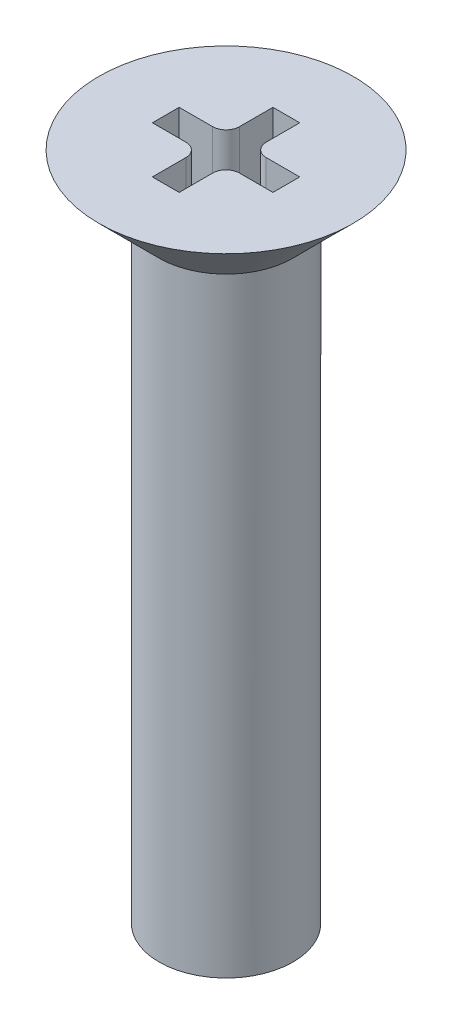
ISO-10303-21;
HEADER;
FILE_DESCRIPTION(('STEP AP214'),'2;1');
FILE_NAME('part.step','',(''),(''),'','','');
FILE_SCHEMA(('AUTOMOTIVE_DESIGN { 1 0 10303 214 1 1 1 1 }'));
ENDSEC;
DATA;
#1=APPLICATION_CONTEXT('core data for automotive mechanical design processes');
#2=APPLICATION_PROTOCOL_DEFINITION('international standard','automotive_design',2000,#1);
#3=PRODUCT_CONTEXT('',#1,'mechanical');
#4=PRODUCT('Part','Part','',(#3));
#5=PRODUCT_RELATED_PRODUCT_CATEGORY('part','',(#4));
#6=PRODUCT_DEFINITION_FORMATION('','',#4);
#7=PRODUCT_DEFINITION_CONTEXT('part definition',#1,'design');
#8=PRODUCT_DEFINITION('design','',#6,#7);
#9=PRODUCT_DEFINITION_SHAPE('','',#8);
#10=(LENGTH_UNIT() NAMED_UNIT(*) SI_UNIT(.MILLI.,.METRE.));
#11=(NAMED_UNIT(*) PLANE_ANGLE_UNIT() SI_UNIT($,.RADIAN.));
#12=(NAMED_UNIT(*) SI_UNIT($,.STERADIAN.) SOLID_ANGLE_UNIT());
#13=UNCERTAINTY_MEASURE_WITH_UNIT(LENGTH_MEASURE(1.E-05),#10,'distance_accuracy_value','');
#14=(GEOMETRIC_REPRESENTATION_CONTEXT(3) GLOBAL_UNCERTAINTY_ASSIGNED_CONTEXT((#13)) GLOBAL_UNIT_ASSIGNED_CONTEXT((#10,
#11,#12)) REPRESENTATION_CONTEXT('',''));
#15=CARTESIAN_POINT('',(0.,0.,0.));
#16=DIRECTION('',(0.,0.,1.));
#17=DIRECTION('',(1.,0.,0.));
#18=AXIS2_PLACEMENT_3D('',#15,#16,#17);
#19=CARTESIAN_POINT('',(0.,0.,0.));
#20=DIRECTION('',(0.,1.,0.));
#21=DIRECTION('',(0.,0.,1.));
#22=AXIS2_PLACEMENT_3D('',#19,#20,#21);
#23=PLANE('',#22);
#24=CARTESIAN_POINT('',(0.,0.,0.));
#25=DIRECTION('',(0.,1.,0.));
#26=DIRECTION('',(0.,0.,1.));
#27=AXIS2_PLACEMENT_3D('',#24,#25,#26);
#28=CIRCLE('',#27,1.9);
#29=CARTESIAN_POINT('',(0.,0.,1.9));
#30=VERTEX_POINT('',#29);
#31=EDGE_CURVE('E11',#30,#30,#28,.T.);
#32=ORIENTED_EDGE('',*,*,#31,.T.);
#33=EDGE_LOOP('',(#32));
#34=FACE_BOUND('',#33,.T.);
#35=DIRECTION('',(-1.,0.,0.));
#36=VECTOR('',#35,1.);
#37=CARTESIAN_POINT('',(0.4,0.,-0.2));
#38=LINE('',#37,#36);
#39=CARTESIAN_POINT('',(0.9,0.,-0.2));
#40=VERTEX_POINT('',#39);
#41=CARTESIAN_POINT('',(0.4,0.,-0.2));
#42=VERTEX_POINT('',#41);
#43=EDGE_CURVE('E48',#40,#42,#38,.T.);
#44=ORIENTED_EDGE('',*,*,#43,.F.);
#45=DIRECTION('',(0.,0.,-1.));
#46=VECTOR('',#45,1.);
#47=CARTESIAN_POINT('',(0.9,0.,0.2));
#48=LINE('',#47,#46);
#49=CARTESIAN_POINT('',(0.9,0.,0.2));
#50=VERTEX_POINT('',#49);
#51=EDGE_CURVE('E221',#50,#40,#48,.T.);
#52=ORIENTED_EDGE('',*,*,#51,.F.);
#53=DIRECTION('',(1.,0.,0.));
#54=VECTOR('',#53,1.);
#55=CARTESIAN_POINT('',(0.4,0.,0.2));
#56=LINE('',#55,#54);
#57=CARTESIAN_POINT('',(0.4,0.,0.2));
#58=VERTEX_POINT('',#57);
#59=EDGE_CURVE('E219',#58,#50,#56,.T.);
#60=ORIENTED_EDGE('',*,*,#59,.F.);
#61=CARTESIAN_POINT('',(0.4,0.,0.4));
#62=DIRECTION('',(0.,-1.,0.));
#63=DIRECTION('',(0.,0.,1.));
#64=AXIS2_PLACEMENT_3D('',#61,#62,#63);
#65=CIRCLE('',#64,0.2);
#66=CARTESIAN_POINT('',(0.2,0.,0.4));
#67=VERTEX_POINT('',#66);
#68=EDGE_CURVE('E156',#67,#58,#65,.T.);
#69=ORIENTED_EDGE('',*,*,#68,.F.);
#70=DIRECTION('',(0.,0.,-1.));
#71=VECTOR('',#70,1.);
#72=CARTESIAN_POINT('',(0.2,0.,0.9));
#73=LINE('',#72,#71);
#74=CARTESIAN_POINT('',(0.2,0.,0.9));
#75=VERTEX_POINT('',#74);
#76=EDGE_CURVE('E215',#75,#67,#73,.T.);
#77=ORIENTED_EDGE('',*,*,#76,.F.);
#78=DIRECTION('',(1.,0.,0.));
#79=VECTOR('',#78,1.);
#80=CARTESIAN_POINT('',(-0.2,0.,0.9));
#81=LINE('',#80,#79);
#82=CARTESIAN_POINT('',(-0.2,0.,0.9));
#83=VERTEX_POINT('',#82);
#84=EDGE_CURVE('E212',#83,#75,#81,.T.);
#85=ORIENTED_EDGE('',*,*,#84,.F.);
#86=DIRECTION('',(0.,0.,1.));
#87=VECTOR('',#86,1.);
#88=CARTESIAN_POINT('',(-0.2,0.,0.9));
#89=LINE('',#88,#87);
#90=CARTESIAN_POINT('',(-0.2,0.,0.4));
#91=VERTEX_POINT('',#90);
#92=EDGE_CURVE('E209',#91,#83,#89,.T.);
#93=ORIENTED_EDGE('',*,*,#92,.F.);
#94=CARTESIAN_POINT('',(-0.4,0.,0.4));
#95=DIRECTION('',(0.,-1.,0.));
#96=DIRECTION('',(0.,0.,1.));
#97=AXIS2_PLACEMENT_3D('',#94,#95,#96);
#98=CIRCLE('',#97,0.2);
#99=CARTESIAN_POINT('',(-0.4,0.,0.2));
#100=VERTEX_POINT('',#99);
#101=EDGE_CURVE('E206',#100,#91,#98,.T.);
#102=ORIENTED_EDGE('',*,*,#101,.F.);
#103=DIRECTION('',(1.,0.,0.));
#104=VECTOR('',#103,1.);
#105=CARTESIAN_POINT('',(-0.9,0.,0.2));
#106=LINE('',#105,#104);
#107=CARTESIAN_POINT('',(-0.9,0.,0.2));
#108=VERTEX_POINT('',#107);
#109=EDGE_CURVE('E203',#108,#100,#106,.T.);
#110=ORIENTED_EDGE('',*,*,#109,.F.);
#111=DIRECTION('',(0.,0.,1.));
#112=VECTOR('',#111,1.);
#113=CARTESIAN_POINT('',(-0.9,0.,0.2));
#114=LINE('',#113,#112);
#115=CARTESIAN_POINT('',(-0.9,0.,-0.2));
#116=VERTEX_POINT('',#115);
#117=EDGE_CURVE('E200',#116,#108,#114,.T.);
#118=ORIENTED_EDGE('',*,*,#117,.F.);
#119=DIRECTION('',(-1.,0.,0.));
#120=VECTOR('',#119,1.);
#121=CARTESIAN_POINT('',(-0.9,0.,-0.2));
#122=LINE('',#121,#120);
#123=CARTESIAN_POINT('',(-0.4,0.,-0.2));
#124=VERTEX_POINT('',#123);
#125=EDGE_CURVE('E197',#124,#116,#122,.T.);
#126=ORIENTED_EDGE('',*,*,#125,.F.);
#127=CARTESIAN_POINT('',(-0.4,0.,-0.4));
#128=DIRECTION('',(0.,-1.,0.));
#129=DIRECTION('',(0.,0.,1.));
#130=AXIS2_PLACEMENT_3D('',#127,#128,#129);
#131=CIRCLE('',#130,0.2);
#132=CARTESIAN_POINT('',(-0.2,0.,-0.4));
#133=VERTEX_POINT('',#132);
#134=EDGE_CURVE('E194',#133,#124,#131,.T.);
#135=ORIENTED_EDGE('',*,*,#134,.F.);
#136=DIRECTION('',(0.,0.,1.));
#137=VECTOR('',#136,1.);
#138=CARTESIAN_POINT('',(-0.2,0.,-0.4));
#139=LINE('',#138,#137);
#140=CARTESIAN_POINT('',(-0.2,0.,-0.9));
#141=VERTEX_POINT('',#140);
#142=EDGE_CURVE('E191',#141,#133,#139,.T.);
#143=ORIENTED_EDGE('',*,*,#142,.F.);
#144=DIRECTION('',(-1.,0.,0.));
#145=VECTOR('',#144,1.);
#146=CARTESIAN_POINT('',(-0.2,0.,-0.9));
#147=LINE('',#146,#145);
#148=CARTESIAN_POINT('',(0.2,0.,-0.9));
#149=VERTEX_POINT('',#148);
#150=EDGE_CURVE('E188',#149,#141,#147,.T.);
#151=ORIENTED_EDGE('',*,*,#150,.F.);
#152=DIRECTION('',(0.,0.,-1.));
#153=VECTOR('',#152,1.);
#154=CARTESIAN_POINT('',(0.2,0.,-0.4));
#155=LINE('',#154,#153);
#156=CARTESIAN_POINT('',(0.2,0.,-0.4));
#157=VERTEX_POINT('',#156);
#158=EDGE_CURVE('E185',#157,#149,#155,.T.);
#159=ORIENTED_EDGE('',*,*,#158,.F.);
#160=CARTESIAN_POINT('',(0.4,0.,-0.4));
#161=DIRECTION('',(0.,-1.,0.));
#162=DIRECTION('',(0.,0.,1.));
#163=AXIS2_PLACEMENT_3D('',#160,#161,#162);
#164=CIRCLE('',#163,0.2);
#165=EDGE_CURVE('E182',#42,#157,#164,.T.);
#166=ORIENTED_EDGE('',*,*,#165,.F.);
#167=EDGE_LOOP('',(#44,#52,#60,#69,#77,#85,#93,#102,#110,#118,#126,#135,#143,#151,#159,#166));
#168=FACE_BOUND('',#167,.T.);
#169=ADVANCED_FACE('F34',(#34,#168),#23,.T.);
#170=CARTESIAN_POINT('',(0.,0.,0.));
#171=DIRECTION('',(0.,1.,0.));
#172=DIRECTION('',(0.,0.,1.));
#173=AXIS2_PLACEMENT_3D('',#170,#171,#172);
#174=CONICAL_SURFACE('',#173,1.9,0.785398163397447);
#175=CARTESIAN_POINT('',(0.,-0.900000000000003,0.));
#176=DIRECTION('',(0.,1.,0.));
#177=DIRECTION('',(0.,0.,1.));
#178=AXIS2_PLACEMENT_3D('',#175,#176,#177);
#179=CIRCLE('',#178,1.);
#180=CARTESIAN_POINT('',(0.,-0.900000000000003,1.));
#181=VERTEX_POINT('',#180);
#182=EDGE_CURVE('E41',#181,#181,#179,.T.);
#183=ORIENTED_EDGE('',*,*,#182,.T.);
#184=EDGE_LOOP('',(#183));
#185=FACE_BOUND('',#184,.T.);
#186=ORIENTED_EDGE('',*,*,#31,.F.);
#187=EDGE_LOOP('',(#186));
#188=FACE_BOUND('',#187,.T.);
#189=ADVANCED_FACE('F255',(#185,#188),#174,.T.);
#190=CARTESIAN_POINT('',(0.,0.872326938896606,0.));
#191=DIRECTION('',(0.,1.,0.));
#192=DIRECTION('',(0.,0.,1.));
#193=AXIS2_PLACEMENT_3D('',#190,#191,#192);
#194=CYLINDRICAL_SURFACE('',#193,1.);
#195=ORIENTED_EDGE('',*,*,#182,.F.);
#196=EDGE_LOOP('',(#195));
#197=FACE_BOUND('',#196,.T.);
#198=CARTESIAN_POINT('',(0.,-10.,0.));
#199=DIRECTION('',(0.,-1.,0.));
#200=DIRECTION('',(0.,0.,-1.));
#201=AXIS2_PLACEMENT_3D('',#198,#199,#200);
#202=CIRCLE('',#201,1.);
#203=CARTESIAN_POINT('',(0.,-10.,-1.));
#204=VERTEX_POINT('',#203);
#205=EDGE_CURVE('E225',#204,#204,#202,.T.);
#206=ORIENTED_EDGE('',*,*,#205,.F.);
#207=EDGE_LOOP('',(#206));
#208=FACE_BOUND('',#207,.T.);
#209=ADVANCED_FACE('F258',(#197,#208),#194,.T.);
#210=CARTESIAN_POINT('',(0.,-10.,0.));
#211=DIRECTION('',(0.,-1.,0.));
#212=DIRECTION('',(0.,0.,-1.));
#213=AXIS2_PLACEMENT_3D('',#210,#211,#212);
#214=PLANE('',#213);
#215=ORIENTED_EDGE('',*,*,#205,.T.);
#216=EDGE_LOOP('',(#215));
#217=FACE_BOUND('',#216,.T.);
#218=ADVANCED_FACE('F261',(#217),#214,.T.);
#219=CARTESIAN_POINT('',(0.4,-1.,-0.2));
#220=DIRECTION('',(0.,0.,-1.));
#221=DIRECTION('',(-1.,0.,0.));
#222=AXIS2_PLACEMENT_3D('',#219,#220,#221);
#223=PLANE('',#222);
#224=ORIENTED_EDGE('',*,*,#43,.T.);
#225=DIRECTION('',(0.,1.,0.));
#226=VECTOR('',#225,1.);
#227=CARTESIAN_POINT('',(0.4,-1.,-0.2));
#228=LINE('',#227,#226);
#229=CARTESIAN_POINT('',(0.4,-1.,-0.2));
#230=VERTEX_POINT('',#229);
#231=EDGE_CURVE('E108',#230,#42,#228,.T.);
#232=ORIENTED_EDGE('',*,*,#231,.F.);
#233=DIRECTION('',(-1.,0.,0.));
#234=VECTOR('',#233,1.);
#235=CARTESIAN_POINT('',(0.4,-1.,-0.2));
#236=LINE('',#235,#234);
#237=CARTESIAN_POINT('',(0.9,-1.,-0.2));
#238=VERTEX_POINT('',#237);
#239=EDGE_CURVE('E223',#238,#230,#236,.T.);
#240=ORIENTED_EDGE('',*,*,#239,.F.);
#241=DIRECTION('',(0.,1.,0.));
#242=VECTOR('',#241,1.);
#243=CARTESIAN_POINT('',(0.9,-1.,-0.2));
#244=LINE('',#243,#242);
#245=EDGE_CURVE('E56',#238,#40,#244,.T.);
#246=ORIENTED_EDGE('',*,*,#245,.T.);
#247=EDGE_LOOP('',(#224,#232,#240,#246));
#248=FACE_BOUND('',#247,.T.);
#249=ADVANCED_FACE('F266',(#248),#223,.F.);
#250=CARTESIAN_POINT('',(0.9,-1.,0.2));
#251=DIRECTION('',(1.,0.,0.));
#252=DIRECTION('',(0.,0.,-1.));
#253=AXIS2_PLACEMENT_3D('',#250,#251,#252);
#254=PLANE('',#253);
#255=ORIENTED_EDGE('',*,*,#51,.T.);
#256=ORIENTED_EDGE('',*,*,#245,.F.);
#257=DIRECTION('',(0.,0.,-1.));
#258=VECTOR('',#257,1.);
#259=CARTESIAN_POINT('',(0.9,-1.,0.2));
#260=LINE('',#259,#258);
#261=CARTESIAN_POINT('',(0.9,-1.,0.2));
#262=VERTEX_POINT('',#261);
#263=EDGE_CURVE('E168',#262,#238,#260,.T.);
#264=ORIENTED_EDGE('',*,*,#263,.F.);
#265=DIRECTION('',(0.,1.,0.));
#266=VECTOR('',#265,1.);
#267=CARTESIAN_POINT('',(0.9,-1.,0.2));
#268=LINE('',#267,#266);
#269=EDGE_CURVE('E160',#262,#50,#268,.T.);
#270=ORIENTED_EDGE('',*,*,#269,.T.);
#271=EDGE_LOOP('',(#255,#256,#264,#270));
#272=FACE_BOUND('',#271,.T.);
#273=ADVANCED_FACE('F271',(#272),#254,.F.);
#274=CARTESIAN_POINT('',(0.4,-1.,0.2));
#275=DIRECTION('',(0.,0.,1.));
#276=DIRECTION('',(1.,0.,0.));
#277=AXIS2_PLACEMENT_3D('',#274,#275,#276);
#278=PLANE('',#277);
#279=ORIENTED_EDGE('',*,*,#59,.T.);
#280=ORIENTED_EDGE('',*,*,#269,.F.);
#281=DIRECTION('',(1.,0.,0.));
#282=VECTOR('',#281,1.);
#283=CARTESIAN_POINT('',(0.4,-1.,0.2));
#284=LINE('',#283,#282);
#285=CARTESIAN_POINT('',(0.4,-1.,0.2));
#286=VERTEX_POINT('',#285);
#287=EDGE_CURVE('E164',#286,#262,#284,.T.);
#288=ORIENTED_EDGE('',*,*,#287,.F.);
#289=DIRECTION('',(0.,1.,0.));
#290=VECTOR('',#289,1.);
#291=CARTESIAN_POINT('',(0.4,-1.,0.2));
#292=LINE('',#291,#290);
#293=EDGE_CURVE('E149',#286,#58,#292,.T.);
#294=ORIENTED_EDGE('',*,*,#293,.T.);
#295=EDGE_LOOP('',(#279,#280,#288,#294));
#296=FACE_BOUND('',#295,.T.);
#297=ADVANCED_FACE('F165',(#296),#278,.F.);
#298=CARTESIAN_POINT('',(0.4,-1.,0.4));
#299=DIRECTION('',(0.,1.,0.));
#300=DIRECTION('',(0.,0.,1.));
#301=AXIS2_PLACEMENT_3D('',#298,#299,#300);
#302=CYLINDRICAL_SURFACE('',#301,0.2);
#303=ORIENTED_EDGE('',*,*,#68,.T.);
#304=ORIENTED_EDGE('',*,*,#293,.F.);
#305=CARTESIAN_POINT('',(0.4,-1.,0.4));
#306=DIRECTION('',(0.,-1.,0.));
#307=DIRECTION('',(0.,0.,1.));
#308=AXIS2_PLACEMENT_3D('',#305,#306,#307);
#309=CIRCLE('',#308,0.2);
#310=CARTESIAN_POINT('',(0.2,-1.,0.4));
#311=VERTEX_POINT('',#310);
#312=EDGE_CURVE('E153',#311,#286,#309,.T.);
#313=ORIENTED_EDGE('',*,*,#312,.F.);
#314=DIRECTION('',(0.,1.,0.));
#315=VECTOR('',#314,1.);
#316=CARTESIAN_POINT('',(0.2,-1.,0.4));
#317=LINE('',#316,#315);
#318=EDGE_CURVE('E161',#311,#67,#317,.T.);
#319=ORIENTED_EDGE('',*,*,#318,.T.);
#320=EDGE_LOOP('',(#303,#304,#313,#319));
#321=FACE_BOUND('',#320,.T.);
#322=ADVANCED_FACE('F151',(#321),#302,.T.);
#323=CARTESIAN_POINT('',(0.2,-1.,0.9));
#324=DIRECTION('',(1.,0.,0.));
#325=DIRECTION('',(0.,0.,-1.));
#326=AXIS2_PLACEMENT_3D('',#323,#324,#325);
#327=PLANE('',#326);
#328=ORIENTED_EDGE('',*,*,#76,.T.);
#329=ORIENTED_EDGE('',*,*,#318,.F.);
#330=DIRECTION('',(0.,0.,-1.));
#331=VECTOR('',#330,1.);
#332=CARTESIAN_POINT('',(0.2,-1.,0.9));
#333=LINE('',#332,#331);
#334=CARTESIAN_POINT('',(0.2,-1.,0.9));
#335=VERTEX_POINT('',#334);
#336=EDGE_CURVE('E174',#335,#311,#333,.T.);
#337=ORIENTED_EDGE('',*,*,#336,.F.);
#338=DIRECTION('',(0.,1.,0.));
#339=VECTOR('',#338,1.);
#340=CARTESIAN_POINT('',(0.2,-1.,0.9));
#341=LINE('',#340,#339);
#342=EDGE_CURVE('E228',#335,#75,#341,.T.);
#343=ORIENTED_EDGE('',*,*,#342,.T.);
#344=EDGE_LOOP('',(#328,#329,#337,#343));
#345=FACE_BOUND('',#344,.T.);
#346=ADVANCED_FACE('F325',(#345),#327,.F.);
#347=CARTESIAN_POINT('',(-0.2,-1.,0.9));
#348=DIRECTION('',(0.,0.,1.));
#349=DIRECTION('',(1.,0.,0.));
#350=AXIS2_PLACEMENT_3D('',#347,#348,#349);
#351=PLANE('',#350);
#352=ORIENTED_EDGE('',*,*,#84,.T.);
#353=ORIENTED_EDGE('',*,*,#342,.F.);
#354=DIRECTION('',(1.,0.,0.));
#355=VECTOR('',#354,1.);
#356=CARTESIAN_POINT('',(-0.2,-1.,0.9));
#357=LINE('',#356,#355);
#358=CARTESIAN_POINT('',(-0.2,-1.,0.9));
#359=VERTEX_POINT('',#358);
#360=EDGE_CURVE('E176',#359,#335,#357,.T.);
#361=ORIENTED_EDGE('',*,*,#360,.F.);
#362=DIRECTION('',(0.,1.,0.));
#363=VECTOR('',#362,1.);
#364=CARTESIAN_POINT('',(-0.2,-1.,0.9));
#365=LINE('',#364,#363);
#366=EDGE_CURVE('E230',#359,#83,#365,.T.);
#367=ORIENTED_EDGE('',*,*,#366,.T.);
#368=EDGE_LOOP('',(#352,#353,#361,#367));
#369=FACE_BOUND('',#368,.T.);
#370=ADVANCED_FACE('F321',(#369),#351,.F.);
#371=CARTESIAN_POINT('',(-0.2,-1.,0.9));
#372=DIRECTION('',(-1.,0.,0.));
#373=DIRECTION('',(0.,0.,1.));
#374=AXIS2_PLACEMENT_3D('',#371,#372,#373);
#375=PLANE('',#374);
#376=ORIENTED_EDGE('',*,*,#92,.T.);
#377=ORIENTED_EDGE('',*,*,#366,.F.);
#378=DIRECTION('',(0.,0.,1.));
#379=VECTOR('',#378,1.);
#380=CARTESIAN_POINT('',(-0.2,-1.,0.9));
#381=LINE('',#380,#379);
#382=CARTESIAN_POINT('',(-0.2,-1.,0.4));
#383=VERTEX_POINT('',#382);
#384=EDGE_CURVE('E316',#383,#359,#381,.T.);
#385=ORIENTED_EDGE('',*,*,#384,.F.);
#386=DIRECTION('',(0.,1.,0.));
#387=VECTOR('',#386,1.);
#388=CARTESIAN_POINT('',(-0.2,-1.,0.4));
#389=LINE('',#388,#387);
#390=EDGE_CURVE('E232',#383,#91,#389,.T.);
#391=ORIENTED_EDGE('',*,*,#390,.T.);
#392=EDGE_LOOP('',(#376,#377,#385,#391));
#393=FACE_BOUND('',#392,.T.);
#394=ADVANCED_FACE('F330',(#393),#375,.F.);
#395=CARTESIAN_POINT('',(-0.4,-1.,0.4));
#396=DIRECTION('',(0.,1.,0.));
#397=DIRECTION('',(0.,0.,1.));
#398=AXIS2_PLACEMENT_3D('',#395,#396,#397);
#399=CYLINDRICAL_SURFACE('',#398,0.2);
#400=ORIENTED_EDGE('',*,*,#101,.T.);
#401=ORIENTED_EDGE('',*,*,#390,.F.);
#402=CARTESIAN_POINT('',(-0.4,-1.,0.4));
#403=DIRECTION('',(0.,-1.,0.));
#404=DIRECTION('',(0.,0.,1.));
#405=AXIS2_PLACEMENT_3D('',#402,#403,#404);
#406=CIRCLE('',#405,0.2);
#407=CARTESIAN_POINT('',(-0.4,-1.,0.2));
#408=VERTEX_POINT('',#407);
#409=EDGE_CURVE('E313',#408,#383,#406,.T.);
#410=ORIENTED_EDGE('',*,*,#409,.F.);
#411=DIRECTION('',(0.,1.,0.));
#412=VECTOR('',#411,1.);
#413=CARTESIAN_POINT('',(-0.4,-1.,0.2));
#414=LINE('',#413,#412);
#415=EDGE_CURVE('E234',#408,#100,#414,.T.);
#416=ORIENTED_EDGE('',*,*,#415,.T.);
#417=EDGE_LOOP('',(#400,#401,#410,#416));
#418=FACE_BOUND('',#417,.T.);
#419=ADVANCED_FACE('F333',(#418),#399,.T.);
#420=CARTESIAN_POINT('',(-0.9,-1.,0.2));
#421=DIRECTION('',(0.,0.,1.));
#422=DIRECTION('',(1.,0.,0.));
#423=AXIS2_PLACEMENT_3D('',#420,#421,#422);
#424=PLANE('',#423);
#425=ORIENTED_EDGE('',*,*,#109,.T.);
#426=ORIENTED_EDGE('',*,*,#415,.F.);
#427=DIRECTION('',(1.,0.,0.));
#428=VECTOR('',#427,1.);
#429=CARTESIAN_POINT('',(-0.9,-1.,0.2));
#430=LINE('',#429,#428);
#431=CARTESIAN_POINT('',(-0.9,-1.,0.2));
#432=VERTEX_POINT('',#431);
#433=EDGE_CURVE('E310',#432,#408,#430,.T.);
#434=ORIENTED_EDGE('',*,*,#433,.F.);
#435=DIRECTION('',(0.,1.,0.));
#436=VECTOR('',#435,1.);
#437=CARTESIAN_POINT('',(-0.9,-1.,0.2));
#438=LINE('',#437,#436);
#439=EDGE_CURVE('E236',#432,#108,#438,.T.);
#440=ORIENTED_EDGE('',*,*,#439,.T.);
#441=EDGE_LOOP('',(#425,#426,#434,#440));
#442=FACE_BOUND('',#441,.T.);
#443=ADVANCED_FACE('F336',(#442),#424,.F.);
#444=CARTESIAN_POINT('',(-0.9,-1.,0.2));
#445=DIRECTION('',(-1.,0.,0.));
#446=DIRECTION('',(0.,0.,1.));
#447=AXIS2_PLACEMENT_3D('',#444,#445,#446);
#448=PLANE('',#447);
#449=ORIENTED_EDGE('',*,*,#117,.T.);
#450=ORIENTED_EDGE('',*,*,#439,.F.);
#451=DIRECTION('',(0.,0.,1.));
#452=VECTOR('',#451,1.);
#453=CARTESIAN_POINT('',(-0.9,-1.,0.2));
#454=LINE('',#453,#452);
#455=CARTESIAN_POINT('',(-0.9,-1.,-0.2));
#456=VERTEX_POINT('',#455);
#457=EDGE_CURVE('E307',#456,#432,#454,.T.);
#458=ORIENTED_EDGE('',*,*,#457,.F.);
#459=DIRECTION('',(0.,1.,0.));
#460=VECTOR('',#459,1.);
#461=CARTESIAN_POINT('',(-0.9,-1.,-0.2));
#462=LINE('',#461,#460);
#463=EDGE_CURVE('E238',#456,#116,#462,.T.);
#464=ORIENTED_EDGE('',*,*,#463,.T.);
#465=EDGE_LOOP('',(#449,#450,#458,#464));
#466=FACE_BOUND('',#465,.T.);
#467=ADVANCED_FACE('F341',(#466),#448,.F.);
#468=CARTESIAN_POINT('',(-0.9,-1.,-0.2));
#469=DIRECTION('',(0.,0.,-1.));
#470=DIRECTION('',(-1.,0.,0.));
#471=AXIS2_PLACEMENT_3D('',#468,#469,#470);
#472=PLANE('',#471);
#473=ORIENTED_EDGE('',*,*,#125,.T.);
#474=ORIENTED_EDGE('',*,*,#463,.F.);
#475=DIRECTION('',(-1.,0.,0.));
#476=VECTOR('',#475,1.);
#477=CARTESIAN_POINT('',(-0.9,-1.,-0.2));
#478=LINE('',#477,#476);
#479=CARTESIAN_POINT('',(-0.4,-1.,-0.2));
#480=VERTEX_POINT('',#479);
#481=EDGE_CURVE('E304',#480,#456,#478,.T.);
#482=ORIENTED_EDGE('',*,*,#481,.F.);
#483=DIRECTION('',(0.,1.,0.));
#484=VECTOR('',#483,1.);
#485=CARTESIAN_POINT('',(-0.4,-1.,-0.2));
#486=LINE('',#485,#484);
#487=EDGE_CURVE('E240',#480,#124,#486,.T.);
#488=ORIENTED_EDGE('',*,*,#487,.T.);
#489=EDGE_LOOP('',(#473,#474,#482,#488));
#490=FACE_BOUND('',#489,.T.);
#491=ADVANCED_FACE('F345',(#490),#472,.F.);
#492=CARTESIAN_POINT('',(-0.4,-1.,-0.4));
#493=DIRECTION('',(0.,1.,0.));
#494=DIRECTION('',(0.,0.,1.));
#495=AXIS2_PLACEMENT_3D('',#492,#493,#494);
#496=CYLINDRICAL_SURFACE('',#495,0.2);
#497=ORIENTED_EDGE('',*,*,#134,.T.);
#498=ORIENTED_EDGE('',*,*,#487,.F.);
#499=CARTESIAN_POINT('',(-0.4,-1.,-0.4));
#500=DIRECTION('',(0.,-1.,0.));
#501=DIRECTION('',(0.,0.,1.));
#502=AXIS2_PLACEMENT_3D('',#499,#500,#501);
#503=CIRCLE('',#502,0.2);
#504=CARTESIAN_POINT('',(-0.2,-1.,-0.4));
#505=VERTEX_POINT('',#504);
#506=EDGE_CURVE('E301',#505,#480,#503,.T.);
#507=ORIENTED_EDGE('',*,*,#506,.F.);
#508=DIRECTION('',(0.,1.,0.));
#509=VECTOR('',#508,1.);
#510=CARTESIAN_POINT('',(-0.2,-1.,-0.4));
#511=LINE('',#510,#509);
#512=EDGE_CURVE('E242',#505,#133,#511,.T.);
#513=ORIENTED_EDGE('',*,*,#512,.T.);
#514=EDGE_LOOP('',(#497,#498,#507,#513));
#515=FACE_BOUND('',#514,.T.);
#516=ADVANCED_FACE('F348',(#515),#496,.T.);
#517=CARTESIAN_POINT('',(-0.2,-1.,-0.4));
#518=DIRECTION('',(-1.,0.,0.));
#519=DIRECTION('',(0.,0.,1.));
#520=AXIS2_PLACEMENT_3D('',#517,#518,#519);
#521=PLANE('',#520);
#522=ORIENTED_EDGE('',*,*,#142,.T.);
#523=ORIENTED_EDGE('',*,*,#512,.F.);
#524=DIRECTION('',(0.,0.,1.));
#525=VECTOR('',#524,1.);
#526=CARTESIAN_POINT('',(-0.2,-1.,-0.4));
#527=LINE('',#526,#525);
#528=CARTESIAN_POINT('',(-0.2,-1.,-0.9));
#529=VERTEX_POINT('',#528);
#530=EDGE_CURVE('E298',#529,#505,#527,.T.);
#531=ORIENTED_EDGE('',*,*,#530,.F.);
#532=DIRECTION('',(0.,1.,0.));
#533=VECTOR('',#532,1.);
#534=CARTESIAN_POINT('',(-0.2,-1.,-0.9));
#535=LINE('',#534,#533);
#536=EDGE_CURVE('E244',#529,#141,#535,.T.);
#537=ORIENTED_EDGE('',*,*,#536,.T.);
#538=EDGE_LOOP('',(#522,#523,#531,#537));
#539=FACE_BOUND('',#538,.T.);
#540=ADVANCED_FACE('F351',(#539),#521,.F.);
#541=CARTESIAN_POINT('',(-0.2,-1.,-0.9));
#542=DIRECTION('',(0.,0.,-1.));
#543=DIRECTION('',(-1.,0.,0.));
#544=AXIS2_PLACEMENT_3D('',#541,#542,#543);
#545=PLANE('',#544);
#546=ORIENTED_EDGE('',*,*,#150,.T.);
#547=ORIENTED_EDGE('',*,*,#536,.F.);
#548=DIRECTION('',(-1.,0.,0.));
#549=VECTOR('',#548,1.);
#550=CARTESIAN_POINT('',(-0.2,-1.,-0.9));
#551=LINE('',#550,#549);
#552=CARTESIAN_POINT('',(0.2,-1.,-0.9));
#553=VERTEX_POINT('',#552);
#554=EDGE_CURVE('E295',#553,#529,#551,.T.);
#555=ORIENTED_EDGE('',*,*,#554,.F.);
#556=DIRECTION('',(0.,1.,0.));
#557=VECTOR('',#556,1.);
#558=CARTESIAN_POINT('',(0.2,-1.,-0.9));
#559=LINE('',#558,#557);
#560=EDGE_CURVE('E246',#553,#149,#559,.T.);
#561=ORIENTED_EDGE('',*,*,#560,.T.);
#562=EDGE_LOOP('',(#546,#547,#555,#561));
#563=FACE_BOUND('',#562,.T.);
#564=ADVANCED_FACE('F355',(#563),#545,.F.);
#565=CARTESIAN_POINT('',(0.2,-1.,-0.4));
#566=DIRECTION('',(1.,0.,0.));
#567=DIRECTION('',(0.,0.,-1.));
#568=AXIS2_PLACEMENT_3D('',#565,#566,#567);
#569=PLANE('',#568);
#570=ORIENTED_EDGE('',*,*,#158,.T.);
#571=ORIENTED_EDGE('',*,*,#560,.F.);
#572=DIRECTION('',(0.,0.,-1.));
#573=VECTOR('',#572,1.);
#574=CARTESIAN_POINT('',(0.2,-1.,-0.4));
#575=LINE('',#574,#573);
#576=CARTESIAN_POINT('',(0.2,-1.,-0.4));
#577=VERTEX_POINT('',#576);
#578=EDGE_CURVE('E290',#577,#553,#575,.T.);
#579=ORIENTED_EDGE('',*,*,#578,.F.);
#580=DIRECTION('',(0.,1.,0.));
#581=VECTOR('',#580,1.);
#582=CARTESIAN_POINT('',(0.2,-1.,-0.4));
#583=LINE('',#582,#581);
#584=EDGE_CURVE('E248',#577,#157,#583,.T.);
#585=ORIENTED_EDGE('',*,*,#584,.T.);
#586=EDGE_LOOP('',(#570,#571,#579,#585));
#587=FACE_BOUND('',#586,.T.);
#588=ADVANCED_FACE('F357',(#587),#569,.F.);
#589=CARTESIAN_POINT('',(0.4,-1.,-0.4));
#590=DIRECTION('',(0.,1.,0.));
#591=DIRECTION('',(0.,0.,1.));
#592=AXIS2_PLACEMENT_3D('',#589,#590,#591);
#593=CYLINDRICAL_SURFACE('',#592,0.2);
#594=ORIENTED_EDGE('',*,*,#165,.T.);
#595=ORIENTED_EDGE('',*,*,#584,.F.);
#596=CARTESIAN_POINT('',(0.4,-1.,-0.4));
#597=DIRECTION('',(0.,-1.,0.));
#598=DIRECTION('',(0.,0.,1.));
#599=AXIS2_PLACEMENT_3D('',#596,#597,#598);
#600=CIRCLE('',#599,0.2);
#601=EDGE_CURVE('E288',#230,#577,#600,.T.);
#602=ORIENTED_EDGE('',*,*,#601,.F.);
#603=ORIENTED_EDGE('',*,*,#231,.T.);
#604=EDGE_LOOP('',(#594,#595,#602,#603));
#605=FACE_BOUND('',#604,.T.);
#606=ADVANCED_FACE('F285',(#605),#593,.T.);
#607=CARTESIAN_POINT('',(0.4,-1.,0.4));
#608=DIRECTION('',(0.,1.,0.));
#609=DIRECTION('',(0.,0.,1.));
#610=AXIS2_PLACEMENT_3D('',#607,#608,#609);
#611=PLANE('',#610);
#612=ORIENTED_EDGE('',*,*,#239,.T.);
#613=ORIENTED_EDGE('',*,*,#601,.T.);
#614=ORIENTED_EDGE('',*,*,#578,.T.);
#615=ORIENTED_EDGE('',*,*,#554,.T.);
#616=ORIENTED_EDGE('',*,*,#530,.T.);
#617=ORIENTED_EDGE('',*,*,#506,.T.);
#618=ORIENTED_EDGE('',*,*,#481,.T.);
#619=ORIENTED_EDGE('',*,*,#457,.T.);
#620=ORIENTED_EDGE('',*,*,#433,.T.);
#621=ORIENTED_EDGE('',*,*,#409,.T.);
#622=ORIENTED_EDGE('',*,*,#384,.T.);
#623=ORIENTED_EDGE('',*,*,#360,.T.);
#624=ORIENTED_EDGE('',*,*,#336,.T.);
#625=ORIENTED_EDGE('',*,*,#312,.T.);
#626=ORIENTED_EDGE('',*,*,#287,.T.);
#627=ORIENTED_EDGE('',*,*,#263,.T.);
#628=EDGE_LOOP('',(#612,#613,#614,#615,#616,#617,#618,#619,#620,#621,#622,#623,#624,#625,#626,#627));
#629=FACE_BOUND('',#628,.T.);
#630=ADVANCED_FACE('F171',(#629),#611,.T.);
#631=CLOSED_SHELL('',(#169,#189,#209,#218,#249,#273,#297,#322,#346,#370,#394,#419,#443,#467,
#491,#516,#540,#564,#588,#606,#630));
#632=MANIFOLD_SOLID_BREP('B2',#631);
#633=ADVANCED_BREP_SHAPE_REPRESENTATION('',(#18,#632),#14);
#634=SHAPE_DEFINITION_REPRESENTATION(#9,#633);
ENDSEC;
END-ISO-10303-21;
